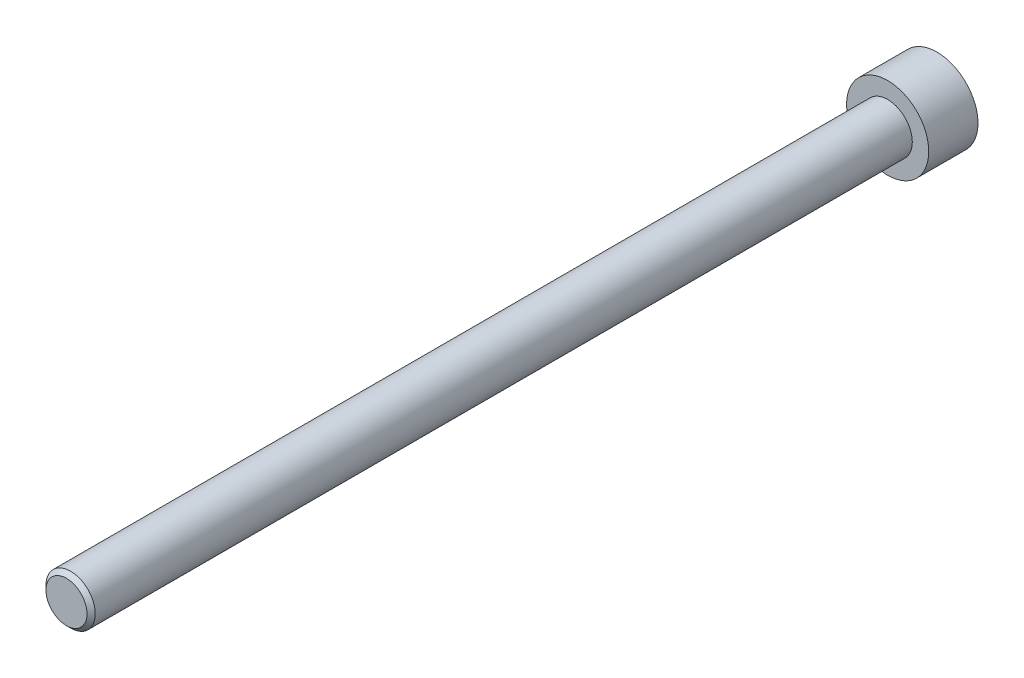
ISO-10303-21;
HEADER;
FILE_DESCRIPTION(('STEP AP214'),'2;1');
FILE_NAME('part.step','',(''),(''),'','','');
FILE_SCHEMA(('AUTOMOTIVE_DESIGN { 1 0 10303 214 1 1 1 1 }'));
ENDSEC;
DATA;
#1=APPLICATION_CONTEXT('core data for automotive mechanical design processes');
#2=APPLICATION_PROTOCOL_DEFINITION('international standard','automotive_design',2000,#1);
#3=PRODUCT_CONTEXT('',#1,'mechanical');
#4=PRODUCT('Part','Part','',(#3));
#5=PRODUCT_RELATED_PRODUCT_CATEGORY('part','',(#4));
#6=PRODUCT_DEFINITION_FORMATION('','',#4);
#7=PRODUCT_DEFINITION_CONTEXT('part definition',#1,'design');
#8=PRODUCT_DEFINITION('design','',#6,#7);
#9=PRODUCT_DEFINITION_SHAPE('','',#8);
#10=(LENGTH_UNIT() NAMED_UNIT(*) SI_UNIT(.MILLI.,.METRE.));
#11=(NAMED_UNIT(*) PLANE_ANGLE_UNIT() SI_UNIT($,.RADIAN.));
#12=(NAMED_UNIT(*) SI_UNIT($,.STERADIAN.) SOLID_ANGLE_UNIT());
#13=UNCERTAINTY_MEASURE_WITH_UNIT(LENGTH_MEASURE(1.E-05),#10,'distance_accuracy_value','');
#14=(GEOMETRIC_REPRESENTATION_CONTEXT(3) GLOBAL_UNCERTAINTY_ASSIGNED_CONTEXT((#13)) GLOBAL_UNIT_ASSIGNED_CONTEXT((#10,
#11,#12)) REPRESENTATION_CONTEXT('',''));
#15=CARTESIAN_POINT('',(0.,0.,0.));
#16=DIRECTION('',(0.,0.,1.));
#17=DIRECTION('',(1.,0.,0.));
#18=AXIS2_PLACEMENT_3D('',#15,#16,#17);
#19=CARTESIAN_POINT('',(0.,0.,6.));
#20=DIRECTION('',(0.,0.,-1.));
#21=DIRECTION('',(-1.,0.,0.));
#22=AXIS2_PLACEMENT_3D('',#19,#20,#21);
#23=CYLINDRICAL_SURFACE('',#22,5.);
#24=CARTESIAN_POINT('',(0.,0.,6.));
#25=DIRECTION('',(0.,0.,1.));
#26=DIRECTION('',(1.,0.,0.));
#27=AXIS2_PLACEMENT_3D('',#24,#25,#26);
#28=CIRCLE('',#27,5.);
#29=CARTESIAN_POINT('',(5.,0.,6.));
#30=VERTEX_POINT('',#29);
#31=EDGE_CURVE('E171',#30,#30,#28,.T.);
#32=ORIENTED_EDGE('',*,*,#31,.F.);
#33=EDGE_LOOP('',(#32));
#34=FACE_BOUND('',#33,.T.);
#35=CARTESIAN_POINT('',(0.,0.,0.));
#36=DIRECTION('',(0.,0.,1.));
#37=DIRECTION('',(1.,0.,0.));
#38=AXIS2_PLACEMENT_3D('',#35,#36,#37);
#39=CIRCLE('',#38,5.);
#40=CARTESIAN_POINT('',(5.,0.,0.));
#41=VERTEX_POINT('',#40);
#42=EDGE_CURVE('E157',#41,#41,#39,.T.);
#43=ORIENTED_EDGE('',*,*,#42,.T.);
#44=EDGE_LOOP('',(#43));
#45=FACE_BOUND('',#44,.T.);
#46=ADVANCED_FACE('F41',(#34,#45),#23,.T.);
#47=CARTESIAN_POINT('',(0.,0.,6.));
#48=DIRECTION('',(0.,0.,1.));
#49=DIRECTION('',(1.,0.,0.));
#50=AXIS2_PLACEMENT_3D('',#47,#48,#49);
#51=PLANE('',#50);
#52=CARTESIAN_POINT('',(0.,0.,6.));
#53=DIRECTION('',(0.,0.,1.));
#54=DIRECTION('',(1.,0.,0.));
#55=AXIS2_PLACEMENT_3D('',#52,#53,#54);
#56=CIRCLE('',#55,3.);
#57=CARTESIAN_POINT('',(3.,0.,6.));
#58=VERTEX_POINT('',#57);
#59=EDGE_CURVE('E167',#58,#58,#56,.T.);
#60=ORIENTED_EDGE('',*,*,#59,.F.);
#61=EDGE_LOOP('',(#60));
#62=FACE_BOUND('',#61,.T.);
#63=ORIENTED_EDGE('',*,*,#31,.T.);
#64=EDGE_LOOP('',(#63));
#65=FACE_BOUND('',#64,.T.);
#66=ADVANCED_FACE('F196',(#62,#65),#51,.T.);
#67=CARTESIAN_POINT('',(0.,0.,0.));
#68=DIRECTION('',(0.,0.,1.));
#69=DIRECTION('',(1.,0.,0.));
#70=AXIS2_PLACEMENT_3D('',#67,#68,#69);
#71=PLANE('',#70);
#72=DIRECTION('',(-0.977443096822646,-0.211198940512861,0.));
#73=VECTOR('',#72,1.);
#74=CARTESIAN_POINT('',(1.93881493895239,-2.13876832916246,0.));
#75=LINE('',#74,#73);
#76=CARTESIAN_POINT('',(1.93881493895239,-2.13876832916246,0.));
#77=VERTEX_POINT('',#76);
#78=CARTESIAN_POINT('',(-0.882820236388089,-2.74844715495077,0.));
#79=VERTEX_POINT('',#78);
#80=EDGE_CURVE('E138',#77,#79,#75,.T.);
#81=ORIENTED_EDGE('',*,*,#80,.F.);
#82=DIRECTION('',(-0.305817900674828,-0.952090022858575,0.));
#83=VECTOR('',#82,1.);
#84=CARTESIAN_POINT('',(2.82163517534048,0.609678825788319,0.));
#85=LINE('',#84,#83);
#86=CARTESIAN_POINT('',(2.82163517534048,0.609678825788319,0.));
#87=VERTEX_POINT('',#86);
#88=EDGE_CURVE('E58',#87,#77,#85,.T.);
#89=ORIENTED_EDGE('',*,*,#88,.F.);
#90=DIRECTION('',(0.671625196147819,-0.740891082345714,0.));
#91=VECTOR('',#90,1.);
#92=CARTESIAN_POINT('',(0.882820236388089,2.74844715495078,0.));
#93=LINE('',#92,#91);
#94=CARTESIAN_POINT('',(0.882820236388089,2.74844715495078,0.));
#95=VERTEX_POINT('',#94);
#96=EDGE_CURVE('E151',#95,#87,#93,.T.);
#97=ORIENTED_EDGE('',*,*,#96,.F.);
#98=DIRECTION('',(0.977443096822646,0.211198940512861,0.));
#99=VECTOR('',#98,1.);
#100=CARTESIAN_POINT('',(-1.93881493895239,2.13876832916246,0.));
#101=LINE('',#100,#99);
#102=CARTESIAN_POINT('',(-1.93881493895239,2.13876832916246,0.));
#103=VERTEX_POINT('',#102);
#104=EDGE_CURVE('E148',#103,#95,#101,.T.);
#105=ORIENTED_EDGE('',*,*,#104,.F.);
#106=DIRECTION('',(0.305817900674828,0.952090022858575,0.));
#107=VECTOR('',#106,1.);
#108=CARTESIAN_POINT('',(-2.82163517534048,-0.609678825788318,0.));
#109=LINE('',#108,#107);
#110=CARTESIAN_POINT('',(-2.82163517534048,-0.609678825788318,0.));
#111=VERTEX_POINT('',#110);
#112=EDGE_CURVE('E106',#111,#103,#109,.T.);
#113=ORIENTED_EDGE('',*,*,#112,.F.);
#114=DIRECTION('',(-0.671625196147819,0.740891082345714,0.));
#115=VECTOR('',#114,1.);
#116=CARTESIAN_POINT('',(-0.882820236388089,-2.74844715495077,0.));
#117=LINE('',#116,#115);
#118=EDGE_CURVE('E142',#79,#111,#117,.T.);
#119=ORIENTED_EDGE('',*,*,#118,.F.);
#120=EDGE_LOOP('',(#81,#89,#97,#105,#113,#119));
#121=FACE_BOUND('',#120,.T.);
#122=ORIENTED_EDGE('',*,*,#42,.F.);
#123=EDGE_LOOP('',(#122));
#124=FACE_BOUND('',#123,.T.);
#125=ADVANCED_FACE('F201',(#121,#124),#71,.F.);
#126=CARTESIAN_POINT('',(0.,0.,106.));
#127=DIRECTION('',(0.,0.,-1.));
#128=DIRECTION('',(-1.,0.,0.));
#129=AXIS2_PLACEMENT_3D('',#126,#127,#128);
#130=CYLINDRICAL_SURFACE('',#129,3.);
#131=CARTESIAN_POINT('',(0.,0.,105.5));
#132=DIRECTION('',(0.,0.,1.));
#133=DIRECTION('',(1.,0.,0.));
#134=AXIS2_PLACEMENT_3D('',#131,#132,#133);
#135=CIRCLE('',#134,3.);
#136=CARTESIAN_POINT('',(3.,0.,105.5));
#137=VERTEX_POINT('',#136);
#138=EDGE_CURVE('E11',#137,#137,#135,.F.);
#139=ORIENTED_EDGE('',*,*,#138,.T.);
#140=EDGE_LOOP('',(#139));
#141=FACE_BOUND('',#140,.T.);
#142=ORIENTED_EDGE('',*,*,#59,.T.);
#143=EDGE_LOOP('',(#142));
#144=FACE_BOUND('',#143,.T.);
#145=ADVANCED_FACE('F192',(#141,#144),#130,.T.);
#146=CARTESIAN_POINT('',(0.,0.,106.));
#147=DIRECTION('',(0.,0.,1.));
#148=DIRECTION('',(1.,0.,0.));
#149=AXIS2_PLACEMENT_3D('',#146,#147,#148);
#150=PLANE('',#149);
#151=CARTESIAN_POINT('',(0.,0.,106.));
#152=DIRECTION('',(0.,0.,1.));
#153=DIRECTION('',(1.,0.,0.));
#154=AXIS2_PLACEMENT_3D('',#151,#152,#153);
#155=CIRCLE('',#154,2.5);
#156=CARTESIAN_POINT('',(2.5,0.,106.));
#157=VERTEX_POINT('',#156);
#158=EDGE_CURVE('E51',#157,#157,#155,.T.);
#159=ORIENTED_EDGE('',*,*,#158,.T.);
#160=EDGE_LOOP('',(#159));
#161=FACE_BOUND('',#160,.T.);
#162=ADVANCED_FACE('F181',(#161),#150,.T.);
#163=CARTESIAN_POINT('',(0.,0.,106.));
#164=DIRECTION('',(0.,0.,-1.));
#165=DIRECTION('',(-1.,0.,0.));
#166=AXIS2_PLACEMENT_3D('',#163,#164,#165);
#167=CONICAL_SURFACE('',#166,2.5,0.785398163397432);
#168=ORIENTED_EDGE('',*,*,#138,.F.);
#169=EDGE_LOOP('',(#168));
#170=FACE_BOUND('',#169,.T.);
#171=ORIENTED_EDGE('',*,*,#158,.F.);
#172=EDGE_LOOP('',(#171));
#173=FACE_BOUND('',#172,.T.);
#174=ADVANCED_FACE('F44',(#170,#173),#167,.T.);
#175=CARTESIAN_POINT('',(2.82163517534048,0.609678825788319,3.5));
#176=DIRECTION('',(0.952090022858575,-0.305817900674828,0.));
#177=DIRECTION('',(0.305817900674828,0.952090022858575,0.));
#178=AXIS2_PLACEMENT_3D('',#175,#176,#177);
#179=PLANE('',#178);
#180=ORIENTED_EDGE('',*,*,#88,.T.);
#181=DIRECTION('',(0.,0.,-1.));
#182=VECTOR('',#181,1.);
#183=CARTESIAN_POINT('',(1.93881493895239,-2.13876832916246,3.5));
#184=LINE('',#183,#182);
#185=CARTESIAN_POINT('',(1.93881493895239,-2.13876832916246,3.5));
#186=VERTEX_POINT('',#185);
#187=EDGE_CURVE('E88',#186,#77,#184,.T.);
#188=ORIENTED_EDGE('',*,*,#187,.F.);
#189=DIRECTION('',(-0.305817900674828,-0.952090022858575,0.));
#190=VECTOR('',#189,1.);
#191=CARTESIAN_POINT('',(2.82163517534048,0.609678825788319,3.5));
#192=LINE('',#191,#190);
#193=CARTESIAN_POINT('',(2.82163517534048,0.609678825788319,3.5));
#194=VERTEX_POINT('',#193);
#195=EDGE_CURVE('E154',#194,#186,#192,.T.);
#196=ORIENTED_EDGE('',*,*,#195,.F.);
#197=DIRECTION('',(0.,0.,-1.));
#198=VECTOR('',#197,1.);
#199=CARTESIAN_POINT('',(2.82163517534048,0.609678825788319,3.5));
#200=LINE('',#199,#198);
#201=EDGE_CURVE('E66',#194,#87,#200,.T.);
#202=ORIENTED_EDGE('',*,*,#201,.T.);
#203=EDGE_LOOP('',(#180,#188,#196,#202));
#204=FACE_BOUND('',#203,.T.);
#205=ADVANCED_FACE('F184',(#204),#179,.F.);
#206=CARTESIAN_POINT('',(0.882820236388089,2.74844715495078,3.5));
#207=DIRECTION('',(0.740891082345714,0.671625196147819,0.));
#208=DIRECTION('',(-0.671625196147819,0.740891082345714,0.));
#209=AXIS2_PLACEMENT_3D('',#206,#207,#208);
#210=PLANE('',#209);
#211=ORIENTED_EDGE('',*,*,#96,.T.);
#212=ORIENTED_EDGE('',*,*,#201,.F.);
#213=DIRECTION('',(0.671625196147819,-0.740891082345714,0.));
#214=VECTOR('',#213,1.);
#215=CARTESIAN_POINT('',(0.882820236388089,2.74844715495078,3.5));
#216=LINE('',#215,#214);
#217=CARTESIAN_POINT('',(0.882820236388089,2.74844715495078,3.5));
#218=VERTEX_POINT('',#217);
#219=EDGE_CURVE('E120',#218,#194,#216,.T.);
#220=ORIENTED_EDGE('',*,*,#219,.F.);
#221=DIRECTION('',(0.,0.,-1.));
#222=VECTOR('',#221,1.);
#223=CARTESIAN_POINT('',(0.882820236388089,2.74844715495078,3.5));
#224=LINE('',#223,#222);
#225=EDGE_CURVE('E111',#218,#95,#224,.T.);
#226=ORIENTED_EDGE('',*,*,#225,.T.);
#227=EDGE_LOOP('',(#211,#212,#220,#226));
#228=FACE_BOUND('',#227,.T.);
#229=ADVANCED_FACE('F190',(#228),#210,.F.);
#230=CARTESIAN_POINT('',(-1.93881493895239,2.13876832916246,3.5));
#231=DIRECTION('',(-0.211198940512861,0.977443096822646,0.));
#232=DIRECTION('',(-0.977443096822647,-0.211198940512861,0.));
#233=AXIS2_PLACEMENT_3D('',#230,#231,#232);
#234=PLANE('',#233);
#235=ORIENTED_EDGE('',*,*,#104,.T.);
#236=ORIENTED_EDGE('',*,*,#225,.F.);
#237=DIRECTION('',(0.977443096822646,0.211198940512861,0.));
#238=VECTOR('',#237,1.);
#239=CARTESIAN_POINT('',(-1.93881493895239,2.13876832916246,3.5));
#240=LINE('',#239,#238);
#241=CARTESIAN_POINT('',(-1.93881493895239,2.13876832916246,3.5));
#242=VERTEX_POINT('',#241);
#243=EDGE_CURVE('E115',#242,#218,#240,.T.);
#244=ORIENTED_EDGE('',*,*,#243,.F.);
#245=DIRECTION('',(0.,0.,-1.));
#246=VECTOR('',#245,1.);
#247=CARTESIAN_POINT('',(-1.93881493895239,2.13876832916246,3.5));
#248=LINE('',#247,#246);
#249=EDGE_CURVE('E99',#242,#103,#248,.T.);
#250=ORIENTED_EDGE('',*,*,#249,.T.);
#251=EDGE_LOOP('',(#235,#236,#244,#250));
#252=FACE_BOUND('',#251,.T.);
#253=ADVANCED_FACE('F116',(#252),#234,.F.);
#254=CARTESIAN_POINT('',(-2.82163517534048,-0.609678825788318,3.5));
#255=DIRECTION('',(-0.952090022858575,0.305817900674828,0.));
#256=DIRECTION('',(-0.305817900674828,-0.952090022858575,0.));
#257=AXIS2_PLACEMENT_3D('',#254,#255,#256);
#258=PLANE('',#257);
#259=ORIENTED_EDGE('',*,*,#112,.T.);
#260=ORIENTED_EDGE('',*,*,#249,.F.);
#261=DIRECTION('',(0.305817900674828,0.952090022858575,0.));
#262=VECTOR('',#261,1.);
#263=CARTESIAN_POINT('',(-2.82163517534048,-0.609678825788318,3.5));
#264=LINE('',#263,#262);
#265=CARTESIAN_POINT('',(-2.82163517534048,-0.609678825788318,3.5));
#266=VERTEX_POINT('',#265);
#267=EDGE_CURVE('E103',#266,#242,#264,.T.);
#268=ORIENTED_EDGE('',*,*,#267,.F.);
#269=DIRECTION('',(0.,0.,-1.));
#270=VECTOR('',#269,1.);
#271=CARTESIAN_POINT('',(-2.82163517534048,-0.609678825788318,3.5));
#272=LINE('',#271,#270);
#273=EDGE_CURVE('E112',#266,#111,#272,.T.);
#274=ORIENTED_EDGE('',*,*,#273,.T.);
#275=EDGE_LOOP('',(#259,#260,#268,#274));
#276=FACE_BOUND('',#275,.T.);
#277=ADVANCED_FACE('F101',(#276),#258,.F.);
#278=CARTESIAN_POINT('',(-0.882820236388089,-2.74844715495077,3.5));
#279=DIRECTION('',(-0.740891082345714,-0.671625196147819,0.));
#280=DIRECTION('',(0.671625196147819,-0.740891082345714,0.));
#281=AXIS2_PLACEMENT_3D('',#278,#279,#280);
#282=PLANE('',#281);
#283=ORIENTED_EDGE('',*,*,#118,.T.);
#284=ORIENTED_EDGE('',*,*,#273,.F.);
#285=DIRECTION('',(-0.671625196147819,0.740891082345714,0.));
#286=VECTOR('',#285,1.);
#287=CARTESIAN_POINT('',(-0.882820236388089,-2.74844715495077,3.5));
#288=LINE('',#287,#286);
#289=CARTESIAN_POINT('',(-0.882820236388089,-2.74844715495077,3.5));
#290=VERTEX_POINT('',#289);
#291=EDGE_CURVE('E126',#290,#266,#288,.T.);
#292=ORIENTED_EDGE('',*,*,#291,.F.);
#293=DIRECTION('',(0.,0.,-1.));
#294=VECTOR('',#293,1.);
#295=CARTESIAN_POINT('',(-0.882820236388089,-2.74844715495077,3.5));
#296=LINE('',#295,#294);
#297=EDGE_CURVE('E162',#290,#79,#296,.T.);
#298=ORIENTED_EDGE('',*,*,#297,.T.);
#299=EDGE_LOOP('',(#283,#284,#292,#298));
#300=FACE_BOUND('',#299,.T.);
#301=ADVANCED_FACE('F216',(#300),#282,.F.);
#302=CARTESIAN_POINT('',(1.93881493895239,-2.13876832916246,3.5));
#303=DIRECTION('',(0.211198940512861,-0.977443096822646,0.));
#304=DIRECTION('',(0.977443096822646,0.211198940512861,0.));
#305=AXIS2_PLACEMENT_3D('',#302,#303,#304);
#306=PLANE('',#305);
#307=ORIENTED_EDGE('',*,*,#80,.T.);
#308=ORIENTED_EDGE('',*,*,#297,.F.);
#309=DIRECTION('',(-0.977443096822646,-0.211198940512861,0.));
#310=VECTOR('',#309,1.);
#311=CARTESIAN_POINT('',(1.93881493895239,-2.13876832916246,3.5));
#312=LINE('',#311,#310);
#313=EDGE_CURVE('E130',#186,#290,#312,.T.);
#314=ORIENTED_EDGE('',*,*,#313,.F.);
#315=ORIENTED_EDGE('',*,*,#187,.T.);
#316=EDGE_LOOP('',(#307,#308,#314,#315));
#317=FACE_BOUND('',#316,.T.);
#318=ADVANCED_FACE('F213',(#317),#306,.F.);
#319=CARTESIAN_POINT('',(0.,0.,3.5));
#320=DIRECTION('',(0.,0.,-1.));
#321=DIRECTION('',(-1.,0.,0.));
#322=AXIS2_PLACEMENT_3D('',#319,#320,#321);
#323=PLANE('',#322);
#324=ORIENTED_EDGE('',*,*,#195,.T.);
#325=ORIENTED_EDGE('',*,*,#313,.T.);
#326=ORIENTED_EDGE('',*,*,#291,.T.);
#327=ORIENTED_EDGE('',*,*,#267,.T.);
#328=ORIENTED_EDGE('',*,*,#243,.T.);
#329=ORIENTED_EDGE('',*,*,#219,.T.);
#330=EDGE_LOOP('',(#324,#325,#326,#327,#328,#329));
#331=FACE_BOUND('',#330,.T.);
#332=ADVANCED_FACE('F123',(#331),#323,.T.);
#333=CLOSED_SHELL('',(#46,#66,#125,#145,#162,#174,#205,#229,#253,#277,#301,#318,#332));
#334=MANIFOLD_SOLID_BREP('B2',#333);
#335=ADVANCED_BREP_SHAPE_REPRESENTATION('',(#18,#334),#14);
#336=SHAPE_DEFINITION_REPRESENTATION(#9,#335);
ENDSEC;
END-ISO-10303-21;
